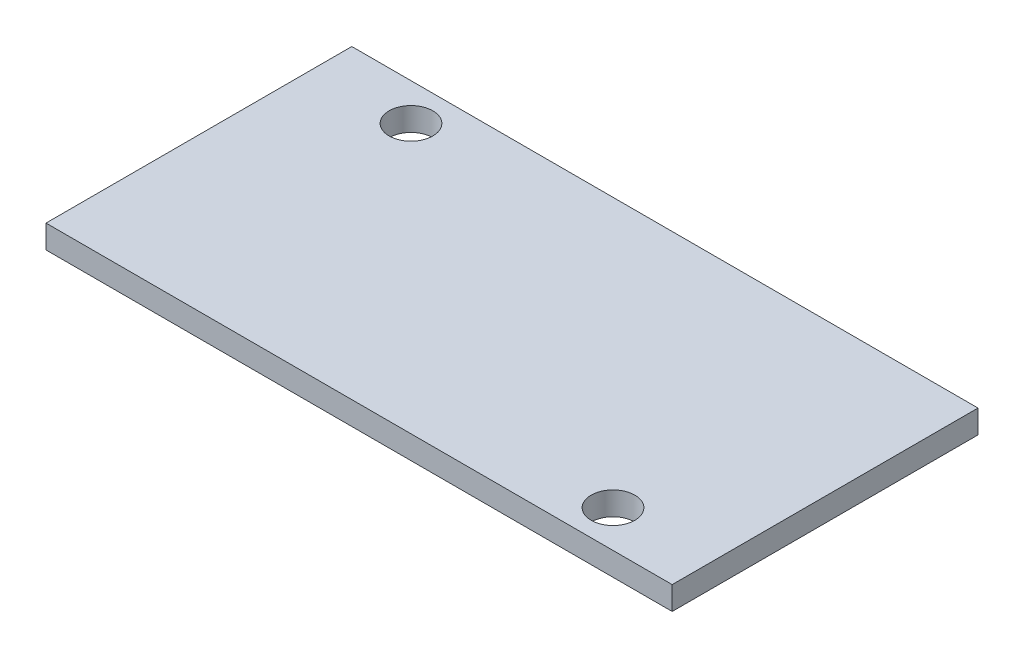
ISO-10303-21;
HEADER;
FILE_DESCRIPTION(('STEP AP214'),'2;1');
FILE_NAME('part.step','',(''),(''),'','','');
FILE_SCHEMA(('AUTOMOTIVE_DESIGN { 1 0 10303 214 1 1 1 1 }'));
ENDSEC;
DATA;
#1=APPLICATION_CONTEXT('core data for automotive mechanical design processes');
#2=APPLICATION_PROTOCOL_DEFINITION('international standard','automotive_design',2000,#1);
#3=PRODUCT_CONTEXT('',#1,'mechanical');
#4=PRODUCT('Part','Part','',(#3));
#5=PRODUCT_RELATED_PRODUCT_CATEGORY('part','',(#4));
#6=PRODUCT_DEFINITION_FORMATION('','',#4);
#7=PRODUCT_DEFINITION_CONTEXT('part definition',#1,'design');
#8=PRODUCT_DEFINITION('design','',#6,#7);
#9=PRODUCT_DEFINITION_SHAPE('','',#8);
#10=(LENGTH_UNIT() NAMED_UNIT(*) SI_UNIT(.MILLI.,.METRE.));
#11=(NAMED_UNIT(*) PLANE_ANGLE_UNIT() SI_UNIT($,.RADIAN.));
#12=(NAMED_UNIT(*) SI_UNIT($,.STERADIAN.) SOLID_ANGLE_UNIT());
#13=UNCERTAINTY_MEASURE_WITH_UNIT(LENGTH_MEASURE(1.E-05),#10,'distance_accuracy_value','');
#14=(GEOMETRIC_REPRESENTATION_CONTEXT(3) GLOBAL_UNCERTAINTY_ASSIGNED_CONTEXT((#13)) GLOBAL_UNIT_ASSIGNED_CONTEXT((#10,
#11,#12)) REPRESENTATION_CONTEXT('',''));
#15=CARTESIAN_POINT('',(0.,0.,0.));
#16=DIRECTION('',(0.,0.,1.));
#17=DIRECTION('',(1.,0.,0.));
#18=AXIS2_PLACEMENT_3D('',#15,#16,#17);
#19=CARTESIAN_POINT('',(0.,1.6,0.));
#20=DIRECTION('',(0.,1.,0.));
#21=DIRECTION('',(0.,0.,1.));
#22=AXIS2_PLACEMENT_3D('',#19,#20,#21);
#23=PLANE('',#22);
#24=CARTESIAN_POINT('',(-17.2154957126266,1.6,-18.9223581160646));
#25=DIRECTION('',(0.,1.,0.));
#26=DIRECTION('',(0.,0.,1.));
#27=AXIS2_PLACEMENT_3D('',#24,#25,#26);
#28=CIRCLE('',#27,1.5);
#29=CARTESIAN_POINT('',(-17.2154957126266,1.6,-17.4223581160646));
#30=VERTEX_POINT('',#29);
#31=EDGE_CURVE('E104',#30,#30,#28,.T.);
#32=ORIENTED_EDGE('',*,*,#31,.F.);
#33=EDGE_LOOP('',(#32));
#34=FACE_BOUND('',#33,.T.);
#35=DIRECTION('',(0.,0.,1.));
#36=VECTOR('',#35,1.);
#37=CARTESIAN_POINT('',(-23.8194957126266,1.6,-21.4623581160646));
#38=LINE('',#37,#36);
#39=CARTESIAN_POINT('',(-23.8194957126266,1.6,-21.4623581160646));
#40=VERTEX_POINT('',#39);
#41=CARTESIAN_POINT('',(-23.8194957126266,1.6,-0.462358116064602));
#42=VERTEX_POINT('',#41);
#43=EDGE_CURVE('E89',#40,#42,#38,.T.);
#44=ORIENTED_EDGE('',*,*,#43,.T.);
#45=DIRECTION('',(1.,0.,0.));
#46=VECTOR('',#45,1.);
#47=CARTESIAN_POINT('',(-23.8194957126266,1.6,-0.462358116064602));
#48=LINE('',#47,#46);
#49=CARTESIAN_POINT('',(19.1805042873734,1.6,-0.462358116064602));
#50=VERTEX_POINT('',#49);
#51=EDGE_CURVE('E84',#42,#50,#48,.T.);
#52=ORIENTED_EDGE('',*,*,#51,.T.);
#53=DIRECTION('',(0.,0.,-1.));
#54=VECTOR('',#53,1.);
#55=CARTESIAN_POINT('',(19.1805042873734,1.6,-21.4623581160646));
#56=LINE('',#55,#54);
#57=CARTESIAN_POINT('',(19.1805042873734,1.6,-21.4623581160646));
#58=VERTEX_POINT('',#57);
#59=EDGE_CURVE('E87',#50,#58,#56,.T.);
#60=ORIENTED_EDGE('',*,*,#59,.T.);
#61=DIRECTION('',(-1.,0.,0.));
#62=VECTOR('',#61,1.);
#63=CARTESIAN_POINT('',(-23.8194957126266,1.6,-21.4623581160646));
#64=LINE('',#63,#62);
#65=EDGE_CURVE('E54',#58,#40,#64,.T.);
#66=ORIENTED_EDGE('',*,*,#65,.T.);
#67=EDGE_LOOP('',(#44,#52,#60,#66));
#68=FACE_BOUND('',#67,.T.);
#69=CARTESIAN_POINT('',(12.5765042873734,1.6,-3.0023581160646));
#70=DIRECTION('',(0.,1.,0.));
#71=DIRECTION('',(0.,0.,1.));
#72=AXIS2_PLACEMENT_3D('',#69,#70,#71);
#73=CIRCLE('',#72,1.5);
#74=CARTESIAN_POINT('',(12.5765042873734,1.6,-1.5023581160646));
#75=VERTEX_POINT('',#74);
#76=EDGE_CURVE('E119',#75,#75,#73,.T.);
#77=ORIENTED_EDGE('',*,*,#76,.F.);
#78=EDGE_LOOP('',(#77));
#79=FACE_BOUND('',#78,.T.);
#80=ADVANCED_FACE('F37',(#34,#68,#79),#23,.T.);
#81=CARTESIAN_POINT('',(0.,0.,0.));
#82=DIRECTION('',(0.,1.,0.));
#83=DIRECTION('',(0.,0.,1.));
#84=AXIS2_PLACEMENT_3D('',#81,#82,#83);
#85=PLANE('',#84);
#86=CARTESIAN_POINT('',(-17.2154957126266,0.,-18.9223581160646));
#87=DIRECTION('',(0.,1.,0.));
#88=DIRECTION('',(0.,0.,1.));
#89=AXIS2_PLACEMENT_3D('',#86,#87,#88);
#90=CIRCLE('',#89,1.5);
#91=CARTESIAN_POINT('',(-17.2154957126266,0.,-17.4223581160646));
#92=VERTEX_POINT('',#91);
#93=EDGE_CURVE('E116',#92,#92,#90,.T.);
#94=ORIENTED_EDGE('',*,*,#93,.T.);
#95=EDGE_LOOP('',(#94));
#96=FACE_BOUND('',#95,.T.);
#97=DIRECTION('',(0.,0.,1.));
#98=VECTOR('',#97,1.);
#99=CARTESIAN_POINT('',(-23.8194957126266,0.,-21.4623581160646));
#100=LINE('',#99,#98);
#101=CARTESIAN_POINT('',(-23.8194957126266,0.,-21.4623581160646));
#102=VERTEX_POINT('',#101);
#103=CARTESIAN_POINT('',(-23.8194957126266,0.,-0.462358116064602));
#104=VERTEX_POINT('',#103);
#105=EDGE_CURVE('E101',#102,#104,#100,.T.);
#106=ORIENTED_EDGE('',*,*,#105,.F.);
#107=DIRECTION('',(-1.,0.,0.));
#108=VECTOR('',#107,1.);
#109=CARTESIAN_POINT('',(-23.8194957126266,0.,-21.4623581160646));
#110=LINE('',#109,#108);
#111=CARTESIAN_POINT('',(19.1805042873734,0.,-21.4623581160646));
#112=VERTEX_POINT('',#111);
#113=EDGE_CURVE('E77',#112,#102,#110,.T.);
#114=ORIENTED_EDGE('',*,*,#113,.F.);
#115=DIRECTION('',(0.,0.,-1.));
#116=VECTOR('',#115,1.);
#117=CARTESIAN_POINT('',(19.1805042873734,0.,-21.4623581160646));
#118=LINE('',#117,#116);
#119=CARTESIAN_POINT('',(19.1805042873734,0.,-0.462358116064602));
#120=VERTEX_POINT('',#119);
#121=EDGE_CURVE('E71',#120,#112,#118,.T.);
#122=ORIENTED_EDGE('',*,*,#121,.F.);
#123=DIRECTION('',(1.,0.,0.));
#124=VECTOR('',#123,1.);
#125=CARTESIAN_POINT('',(-23.8194957126266,0.,-0.462358116064602));
#126=LINE('',#125,#124);
#127=EDGE_CURVE('E93',#104,#120,#126,.T.);
#128=ORIENTED_EDGE('',*,*,#127,.F.);
#129=EDGE_LOOP('',(#106,#114,#122,#128));
#130=FACE_BOUND('',#129,.T.);
#131=CARTESIAN_POINT('',(12.5765042873734,0.,-3.0023581160646));
#132=DIRECTION('',(0.,1.,0.));
#133=DIRECTION('',(0.,0.,1.));
#134=AXIS2_PLACEMENT_3D('',#131,#132,#133);
#135=CIRCLE('',#134,1.5);
#136=CARTESIAN_POINT('',(12.5765042873734,0.,-1.5023581160646));
#137=VERTEX_POINT('',#136);
#138=EDGE_CURVE('E122',#137,#137,#135,.T.);
#139=ORIENTED_EDGE('',*,*,#138,.T.);
#140=EDGE_LOOP('',(#139));
#141=FACE_BOUND('',#140,.T.);
#142=ADVANCED_FACE('F112',(#96,#130,#141),#85,.F.);
#143=CARTESIAN_POINT('',(-23.8194957126266,1.6,-21.4623581160646));
#144=DIRECTION('',(1.,0.,0.));
#145=DIRECTION('',(0.,0.,-1.));
#146=AXIS2_PLACEMENT_3D('',#143,#144,#145);
#147=PLANE('',#146);
#148=ORIENTED_EDGE('',*,*,#105,.T.);
#149=DIRECTION('',(0.,-1.,0.));
#150=VECTOR('',#149,1.);
#151=CARTESIAN_POINT('',(-23.8194957126266,1.6,-0.462358116064602));
#152=LINE('',#151,#150);
#153=EDGE_CURVE('E11',#42,#104,#152,.T.);
#154=ORIENTED_EDGE('',*,*,#153,.F.);
#155=ORIENTED_EDGE('',*,*,#43,.F.);
#156=DIRECTION('',(0.,-1.,0.));
#157=VECTOR('',#156,1.);
#158=CARTESIAN_POINT('',(-23.8194957126266,1.6,-21.4623581160646));
#159=LINE('',#158,#157);
#160=EDGE_CURVE('E97',#40,#102,#159,.T.);
#161=ORIENTED_EDGE('',*,*,#160,.T.);
#162=EDGE_LOOP('',(#148,#154,#155,#161));
#163=FACE_BOUND('',#162,.T.);
#164=ADVANCED_FACE('F39',(#163),#147,.F.);
#165=CARTESIAN_POINT('',(-23.8194957126266,1.6,-0.462358116064602));
#166=DIRECTION('',(0.,0.,-1.));
#167=DIRECTION('',(-1.,0.,0.));
#168=AXIS2_PLACEMENT_3D('',#165,#166,#167);
#169=PLANE('',#168);
#170=ORIENTED_EDGE('',*,*,#127,.T.);
#171=DIRECTION('',(0.,-1.,0.));
#172=VECTOR('',#171,1.);
#173=CARTESIAN_POINT('',(19.1805042873734,1.6,-0.462358116064602));
#174=LINE('',#173,#172);
#175=EDGE_CURVE('E46',#50,#120,#174,.T.);
#176=ORIENTED_EDGE('',*,*,#175,.F.);
#177=ORIENTED_EDGE('',*,*,#51,.F.);
#178=ORIENTED_EDGE('',*,*,#153,.T.);
#179=EDGE_LOOP('',(#170,#176,#177,#178));
#180=FACE_BOUND('',#179,.T.);
#181=ADVANCED_FACE('F92',(#180),#169,.F.);
#182=CARTESIAN_POINT('',(19.1805042873734,1.6,-21.4623581160646));
#183=DIRECTION('',(-1.,0.,0.));
#184=DIRECTION('',(0.,0.,1.));
#185=AXIS2_PLACEMENT_3D('',#182,#183,#184);
#186=PLANE('',#185);
#187=ORIENTED_EDGE('',*,*,#121,.T.);
#188=DIRECTION('',(0.,-1.,0.));
#189=VECTOR('',#188,1.);
#190=CARTESIAN_POINT('',(19.1805042873734,1.6,-21.4623581160646));
#191=LINE('',#190,#189);
#192=EDGE_CURVE('E94',#58,#112,#191,.T.);
#193=ORIENTED_EDGE('',*,*,#192,.F.);
#194=ORIENTED_EDGE('',*,*,#59,.F.);
#195=ORIENTED_EDGE('',*,*,#175,.T.);
#196=EDGE_LOOP('',(#187,#193,#194,#195));
#197=FACE_BOUND('',#196,.T.);
#198=ADVANCED_FACE('F95',(#197),#186,.F.);
#199=CARTESIAN_POINT('',(-23.8194957126266,1.6,-21.4623581160646));
#200=DIRECTION('',(0.,0.,1.));
#201=DIRECTION('',(1.,0.,0.));
#202=AXIS2_PLACEMENT_3D('',#199,#200,#201);
#203=PLANE('',#202);
#204=ORIENTED_EDGE('',*,*,#113,.T.);
#205=ORIENTED_EDGE('',*,*,#160,.F.);
#206=ORIENTED_EDGE('',*,*,#65,.F.);
#207=ORIENTED_EDGE('',*,*,#192,.T.);
#208=EDGE_LOOP('',(#204,#205,#206,#207));
#209=FACE_BOUND('',#208,.T.);
#210=ADVANCED_FACE('F109',(#209),#203,.F.);
#211=CARTESIAN_POINT('',(-17.2154957126266,1.6,-18.9223581160646));
#212=DIRECTION('',(0.,-1.,0.));
#213=DIRECTION('',(0.,0.,-1.));
#214=AXIS2_PLACEMENT_3D('',#211,#212,#213);
#215=CYLINDRICAL_SURFACE('',#214,1.5);
#216=ORIENTED_EDGE('',*,*,#31,.T.);
#217=EDGE_LOOP('',(#216));
#218=FACE_BOUND('',#217,.T.);
#219=ORIENTED_EDGE('',*,*,#93,.F.);
#220=EDGE_LOOP('',(#219));
#221=FACE_BOUND('',#220,.T.);
#222=ADVANCED_FACE('F140',(#218,#221),#215,.F.);
#223=CARTESIAN_POINT('',(12.5765042873734,1.6,-3.0023581160646));
#224=DIRECTION('',(0.,-1.,0.));
#225=DIRECTION('',(0.,0.,-1.));
#226=AXIS2_PLACEMENT_3D('',#223,#224,#225);
#227=CYLINDRICAL_SURFACE('',#226,1.5);
#228=ORIENTED_EDGE('',*,*,#76,.T.);
#229=EDGE_LOOP('',(#228));
#230=FACE_BOUND('',#229,.T.);
#231=ORIENTED_EDGE('',*,*,#138,.F.);
#232=EDGE_LOOP('',(#231));
#233=FACE_BOUND('',#232,.T.);
#234=ADVANCED_FACE('F128',(#230,#233),#227,.F.);
#235=CLOSED_SHELL('',(#80,#142,#164,#181,#198,#210,#222,#234));
#236=MANIFOLD_SOLID_BREP('B2',#235);
#237=ADVANCED_BREP_SHAPE_REPRESENTATION('',(#18,#236),#14);
#238=SHAPE_DEFINITION_REPRESENTATION(#9,#237);
ENDSEC;
END-ISO-10303-21;
